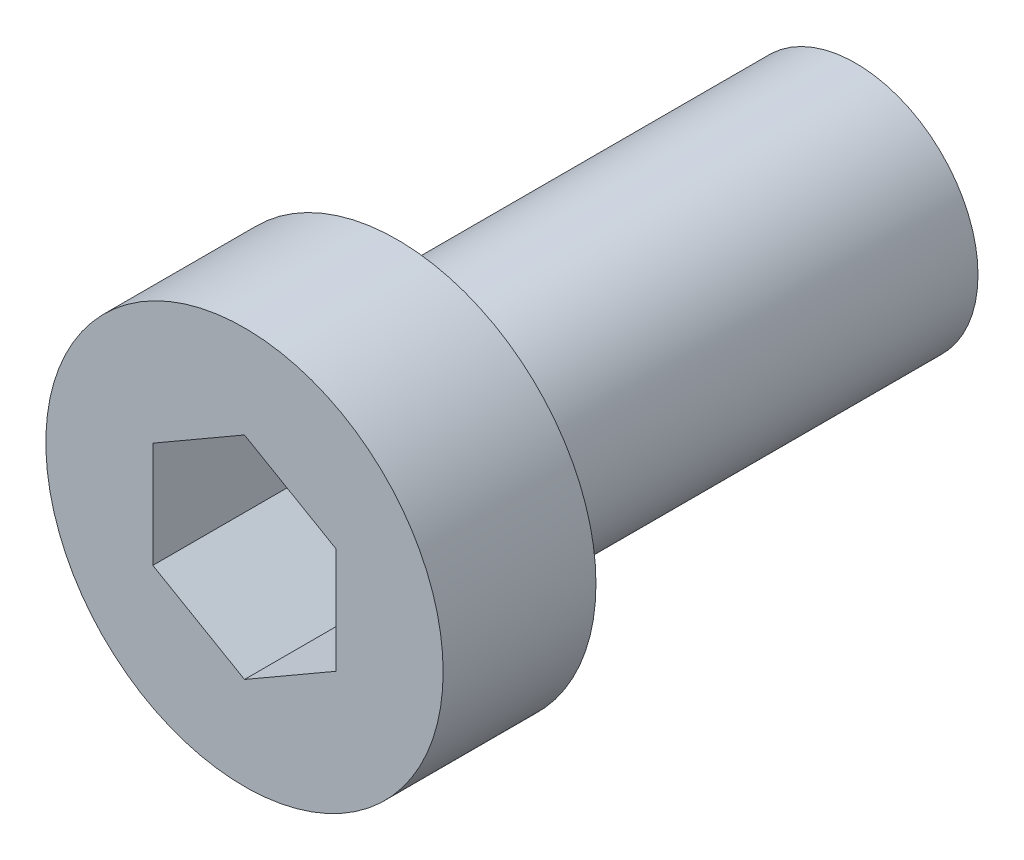
ISO-10303-21;
HEADER;
FILE_DESCRIPTION(('STEP AP214'),'2;1');
FILE_NAME('part.step','',(''),(''),'','','');
FILE_SCHEMA(('AUTOMOTIVE_DESIGN { 1 0 10303 214 1 1 1 1 }'));
ENDSEC;
DATA;
#1=APPLICATION_CONTEXT('core data for automotive mechanical design processes');
#2=APPLICATION_PROTOCOL_DEFINITION('international standard','automotive_design',2000,#1);
#3=PRODUCT_CONTEXT('',#1,'mechanical');
#4=PRODUCT('Part','Part','',(#3));
#5=PRODUCT_RELATED_PRODUCT_CATEGORY('part','',(#4));
#6=PRODUCT_DEFINITION_FORMATION('','',#4);
#7=PRODUCT_DEFINITION_CONTEXT('part definition',#1,'design');
#8=PRODUCT_DEFINITION('design','',#6,#7);
#9=PRODUCT_DEFINITION_SHAPE('','',#8);
#10=(LENGTH_UNIT() NAMED_UNIT(*) SI_UNIT(.MILLI.,.METRE.));
#11=(NAMED_UNIT(*) PLANE_ANGLE_UNIT() SI_UNIT($,.RADIAN.));
#12=(NAMED_UNIT(*) SI_UNIT($,.STERADIAN.) SOLID_ANGLE_UNIT());
#13=UNCERTAINTY_MEASURE_WITH_UNIT(LENGTH_MEASURE(1.E-05),#10,'distance_accuracy_value','');
#14=(GEOMETRIC_REPRESENTATION_CONTEXT(3) GLOBAL_UNCERTAINTY_ASSIGNED_CONTEXT((#13)) GLOBAL_UNIT_ASSIGNED_CONTEXT((#10,
#11,#12)) REPRESENTATION_CONTEXT('',''));
#15=CARTESIAN_POINT('',(0.,0.,0.));
#16=DIRECTION('',(0.,0.,1.));
#17=DIRECTION('',(1.,0.,0.));
#18=AXIS2_PLACEMENT_3D('',#15,#16,#17);
#19=CARTESIAN_POINT('',(0.,0.,4.44089209850063E-13));
#20=DIRECTION('',(0.,0.,0.99999999999998));
#21=DIRECTION('',(1.,0.,0.));
#22=AXIS2_PLACEMENT_3D('',#19,#20,#21);
#23=PLANE('',#22);
#24=CARTESIAN_POINT('',(0.,0.,4.44089209850063E-13));
#25=DIRECTION('',(0.,0.,0.99999999999998));
#26=DIRECTION('',(1.,0.,0.));
#27=AXIS2_PLACEMENT_3D('',#24,#25,#26);
#28=CIRCLE('',#27,6.5);
#29=CARTESIAN_POINT('',(6.5,0.,4.47813769070422E-13));
#30=VERTEX_POINT('',#29);
#31=EDGE_CURVE('E157',#30,#30,#28,.T.);
#32=ORIENTED_EDGE('',*,*,#31,.F.);
#33=EDGE_LOOP('',(#32));
#34=FACE_BOUND('',#33,.T.);
#35=CARTESIAN_POINT('',(0.,0.,4.44089209850063E-13));
#36=DIRECTION('',(0.,0.,0.99999999999998));
#37=DIRECTION('',(1.,0.,0.));
#38=AXIS2_PLACEMENT_3D('',#35,#36,#37);
#39=CIRCLE('',#38,4.);
#40=CARTESIAN_POINT('',(4.,0.,4.46381246293361E-13));
#41=VERTEX_POINT('',#40);
#42=EDGE_CURVE('E11',#41,#41,#39,.F.);
#43=ORIENTED_EDGE('',*,*,#42,.F.);
#44=EDGE_LOOP('',(#43));
#45=FACE_BOUND('',#44,.T.);
#46=ADVANCED_FACE('F47',(#34,#45),#23,.F.);
#47=CARTESIAN_POINT('',(0.,0.,4.99999999999823));
#48=DIRECTION('',(0.,0.,-0.99999999999998));
#49=DIRECTION('',(-1.,0.,0.));
#50=AXIS2_PLACEMENT_3D('',#47,#48,#49);
#51=CYLINDRICAL_SURFACE('',#50,6.5);
#52=CARTESIAN_POINT('',(0.,0.,4.99999999999823));
#53=DIRECTION('',(0.,0.,0.99999999999998));
#54=DIRECTION('',(1.,0.,0.));
#55=AXIS2_PLACEMENT_3D('',#52,#53,#54);
#56=CIRCLE('',#55,6.5);
#57=CARTESIAN_POINT('',(6.5,0.,4.99999999999823));
#58=VERTEX_POINT('',#57);
#59=EDGE_CURVE('E55',#58,#58,#56,.T.);
#60=ORIENTED_EDGE('',*,*,#59,.F.);
#61=EDGE_LOOP('',(#60));
#62=FACE_BOUND('',#61,.T.);
#63=ORIENTED_EDGE('',*,*,#31,.T.);
#64=EDGE_LOOP('',(#63));
#65=FACE_BOUND('',#64,.T.);
#66=ADVANCED_FACE('F49',(#62,#65),#51,.T.);
#67=CARTESIAN_POINT('',(0.,0.,4.99999999999823));
#68=DIRECTION('',(0.,0.,0.99999999999998));
#69=DIRECTION('',(1.,0.,0.));
#70=AXIS2_PLACEMENT_3D('',#67,#68,#69);
#71=PLANE('',#70);
#72=DIRECTION('',(-0.866025403784439,0.50000000000001,0.));
#73=VECTOR('',#72,1.);
#74=CARTESIAN_POINT('',(2.99999999999989,1.73205080756874,4.99999999999778));
#75=LINE('',#74,#73);
#76=CARTESIAN_POINT('',(2.99999999999989,1.73205080756874,4.99999999999778));
#77=VERTEX_POINT('',#76);
#78=CARTESIAN_POINT('',(0.,3.46410161513778,4.99999999999834));
#79=VERTEX_POINT('',#78);
#80=EDGE_CURVE('E62',#77,#79,#75,.T.);
#81=ORIENTED_EDGE('',*,*,#80,.F.);
#82=DIRECTION('',(0.,1.00000000000002,0.));
#83=VECTOR('',#82,1.);
#84=CARTESIAN_POINT('',(2.99999999999989,-1.73205080756893,4.9999999999979));
#85=LINE('',#84,#83);
#86=CARTESIAN_POINT('',(2.99999999999989,-1.73205080756893,4.9999999999979));
#87=VERTEX_POINT('',#86);
#88=EDGE_CURVE('E145',#87,#77,#85,.T.);
#89=ORIENTED_EDGE('',*,*,#88,.F.);
#90=DIRECTION('',(0.866025403784439,0.500000000000009,0.));
#91=VECTOR('',#90,1.);
#92=CARTESIAN_POINT('',(0.,-3.46410161513781,4.99999999999934));
#93=LINE('',#92,#91);
#94=CARTESIAN_POINT('',(0.,-3.46410161513781,4.99999999999934));
#95=VERTEX_POINT('',#94);
#96=EDGE_CURVE('E143',#95,#87,#93,.T.);
#97=ORIENTED_EDGE('',*,*,#96,.F.);
#98=DIRECTION('',(0.866025403784439,-0.500000000000009,0.));
#99=VECTOR('',#98,1.);
#100=CARTESIAN_POINT('',(-3.00000000000011,-1.73205080756885,4.99999999999834));
#101=LINE('',#100,#99);
#102=CARTESIAN_POINT('',(-3.00000000000011,-1.73205080756885,4.99999999999834));
#103=VERTEX_POINT('',#102);
#104=EDGE_CURVE('E110',#103,#95,#101,.T.);
#105=ORIENTED_EDGE('',*,*,#104,.F.);
#106=DIRECTION('',(0.,-1.00000000000002,0.));
#107=VECTOR('',#106,1.);
#108=CARTESIAN_POINT('',(-2.99999999999989,1.73205080756896,4.99999999999823));
#109=LINE('',#108,#107);
#110=CARTESIAN_POINT('',(-2.99999999999989,1.73205080756896,4.99999999999823));
#111=VERTEX_POINT('',#110);
#112=EDGE_CURVE('E139',#111,#103,#109,.T.);
#113=ORIENTED_EDGE('',*,*,#112,.F.);
#114=DIRECTION('',(-0.866025403784439,-0.500000000000009,0.));
#115=VECTOR('',#114,1.);
#116=CARTESIAN_POINT('',(0.,3.46410161513778,4.99999999999834));
#117=LINE('',#116,#115);
#118=EDGE_CURVE('E136',#79,#111,#117,.T.);
#119=ORIENTED_EDGE('',*,*,#118,.F.);
#120=EDGE_LOOP('',(#81,#89,#97,#105,#113,#119));
#121=FACE_BOUND('',#120,.T.);
#122=ORIENTED_EDGE('',*,*,#59,.T.);
#123=EDGE_LOOP('',(#122));
#124=FACE_BOUND('',#123,.T.);
#125=ADVANCED_FACE('F170',(#121,#124),#71,.T.);
#126=CARTESIAN_POINT('',(0.,0.,-14.9999999999996));
#127=DIRECTION('',(0.,0.,0.99999999999998));
#128=DIRECTION('',(1.,0.,0.));
#129=AXIS2_PLACEMENT_3D('',#126,#127,#128);
#130=CYLINDRICAL_SURFACE('',#129,4.);
#131=CARTESIAN_POINT('',(0.,0.,-14.9999999999996));
#132=DIRECTION('',(0.,0.,-0.99999999999998));
#133=DIRECTION('',(-1.,0.,0.));
#134=AXIS2_PLACEMENT_3D('',#131,#132,#133);
#135=CIRCLE('',#134,4.);
#136=CARTESIAN_POINT('',(-4.,0.,-14.9999999999996));
#137=VERTEX_POINT('',#136);
#138=EDGE_CURVE('E149',#137,#137,#135,.T.);
#139=ORIENTED_EDGE('',*,*,#138,.F.);
#140=EDGE_LOOP('',(#139));
#141=FACE_BOUND('',#140,.T.);
#142=ORIENTED_EDGE('',*,*,#42,.T.);
#143=EDGE_LOOP('',(#142));
#144=FACE_BOUND('',#143,.T.);
#145=ADVANCED_FACE('F167',(#141,#144),#130,.T.);
#146=CARTESIAN_POINT('',(0.,0.,-14.9999999999996));
#147=DIRECTION('',(0.,0.,-0.99999999999998));
#148=DIRECTION('',(-1.,0.,0.));
#149=AXIS2_PLACEMENT_3D('',#146,#147,#148);
#150=PLANE('',#149);
#151=ORIENTED_EDGE('',*,*,#138,.T.);
#152=EDGE_LOOP('',(#151));
#153=FACE_BOUND('',#152,.T.);
#154=ADVANCED_FACE('F169',(#153),#150,.T.);
#155=CARTESIAN_POINT('',(2.99999999999989,1.73205080756881,0.));
#156=DIRECTION('',(0.5,0.866025403784458,0.));
#157=DIRECTION('',(-0.866025403784439,0.50000000000001,0.));
#158=AXIS2_PLACEMENT_3D('',#155,#156,#157);
#159=PLANE('',#158);
#160=ORIENTED_EDGE('',*,*,#80,.T.);
#161=DIRECTION('',(0.,0.,0.99999999999998));
#162=VECTOR('',#161,1.);
#163=CARTESIAN_POINT('',(0.,3.46410161513774,4.44089209850063E-13));
#164=LINE('',#163,#162);
#165=CARTESIAN_POINT('',(0.,3.46410161513774,4.44089209850063E-13));
#166=VERTEX_POINT('',#165);
#167=EDGE_CURVE('E92',#166,#79,#164,.T.);
#168=ORIENTED_EDGE('',*,*,#167,.F.);
#169=DIRECTION('',(-0.866025403784439,0.50000000000001,0.));
#170=VECTOR('',#169,1.);
#171=CARTESIAN_POINT('',(2.99999999999989,1.73205080756881,0.));
#172=LINE('',#171,#170);
#173=CARTESIAN_POINT('',(2.99999999999989,1.73205080756881,0.));
#174=VERTEX_POINT('',#173);
#175=EDGE_CURVE('E147',#174,#166,#172,.T.);
#176=ORIENTED_EDGE('',*,*,#175,.F.);
#177=DIRECTION('',(0.,0.,0.99999999999998));
#178=VECTOR('',#177,1.);
#179=CARTESIAN_POINT('',(2.99999999999989,1.73205080756881,0.));
#180=LINE('',#179,#178);
#181=EDGE_CURVE('E70',#174,#77,#180,.T.);
#182=ORIENTED_EDGE('',*,*,#181,.T.);
#183=EDGE_LOOP('',(#160,#168,#176,#182));
#184=FACE_BOUND('',#183,.T.);
#185=ADVANCED_FACE('F177',(#184),#159,.F.);
#186=CARTESIAN_POINT('',(2.99999999999989,-1.73205080756888,0.));
#187=DIRECTION('',(1.,0.,0.));
#188=DIRECTION('',(0.,0.,-0.99999999999998));
#189=AXIS2_PLACEMENT_3D('',#186,#187,#188);
#190=PLANE('',#189);
#191=ORIENTED_EDGE('',*,*,#88,.T.);
#192=ORIENTED_EDGE('',*,*,#181,.F.);
#193=DIRECTION('',(0.,1.00000000000002,0.));
#194=VECTOR('',#193,1.);
#195=CARTESIAN_POINT('',(2.99999999999989,-1.73205080756888,0.));
#196=LINE('',#195,#194);
#197=CARTESIAN_POINT('',(2.99999999999989,-1.73205080756888,0.));
#198=VERTEX_POINT('',#197);
#199=EDGE_CURVE('E122',#198,#174,#196,.T.);
#200=ORIENTED_EDGE('',*,*,#199,.F.);
#201=DIRECTION('',(0.,0.,0.99999999999998));
#202=VECTOR('',#201,1.);
#203=CARTESIAN_POINT('',(2.99999999999989,-1.73205080756888,0.));
#204=LINE('',#203,#202);
#205=EDGE_CURVE('E114',#198,#87,#204,.T.);
#206=ORIENTED_EDGE('',*,*,#205,.T.);
#207=EDGE_LOOP('',(#191,#192,#200,#206));
#208=FACE_BOUND('',#207,.T.);
#209=ADVANCED_FACE('F186',(#208),#190,.F.);
#210=CARTESIAN_POINT('',(0.,-3.46410161513789,4.44089209850063E-13));
#211=DIRECTION('',(0.500000000000001,-0.866025403784458,0.));
#212=DIRECTION('',(0.866025403784439,0.500000000000009,0.));
#213=AXIS2_PLACEMENT_3D('',#210,#211,#212);
#214=PLANE('',#213);
#215=ORIENTED_EDGE('',*,*,#96,.T.);
#216=ORIENTED_EDGE('',*,*,#205,.F.);
#217=DIRECTION('',(0.866025403784439,0.500000000000009,0.));
#218=VECTOR('',#217,1.);
#219=CARTESIAN_POINT('',(0.,-3.46410161513789,4.44089209850063E-13));
#220=LINE('',#219,#218);
#221=CARTESIAN_POINT('',(0.,-3.46410161513789,4.44089209850063E-13));
#222=VERTEX_POINT('',#221);
#223=EDGE_CURVE('E118',#222,#198,#220,.T.);
#224=ORIENTED_EDGE('',*,*,#223,.F.);
#225=DIRECTION('',(0.,0.,0.99999999999998));
#226=VECTOR('',#225,1.);
#227=CARTESIAN_POINT('',(0.,-3.46410161513789,4.44089209850063E-13));
#228=LINE('',#227,#226);
#229=EDGE_CURVE('E103',#222,#95,#228,.T.);
#230=ORIENTED_EDGE('',*,*,#229,.T.);
#231=EDGE_LOOP('',(#215,#216,#224,#230));
#232=FACE_BOUND('',#231,.T.);
#233=ADVANCED_FACE('F119',(#232),#214,.F.);
#234=CARTESIAN_POINT('',(-3.00000000000011,-1.73205080756889,4.44089209850063E-13));
#235=DIRECTION('',(-0.5,-0.866025403784458,0.));
#236=DIRECTION('',(0.866025403784439,-0.500000000000009,0.));
#237=AXIS2_PLACEMENT_3D('',#234,#235,#236);
#238=PLANE('',#237);
#239=ORIENTED_EDGE('',*,*,#104,.T.);
#240=ORIENTED_EDGE('',*,*,#229,.F.);
#241=DIRECTION('',(0.866025403784439,-0.500000000000009,0.));
#242=VECTOR('',#241,1.);
#243=CARTESIAN_POINT('',(-3.00000000000011,-1.73205080756889,4.44089209850063E-13));
#244=LINE('',#243,#242);
#245=CARTESIAN_POINT('',(-3.00000000000011,-1.73205080756889,4.44089209850063E-13));
#246=VERTEX_POINT('',#245);
#247=EDGE_CURVE('E107',#246,#222,#244,.T.);
#248=ORIENTED_EDGE('',*,*,#247,.F.);
#249=DIRECTION('',(0.,0.,0.99999999999998));
#250=VECTOR('',#249,1.);
#251=CARTESIAN_POINT('',(-3.00000000000011,-1.73205080756889,4.44089209850063E-13));
#252=LINE('',#251,#250);
#253=EDGE_CURVE('E115',#246,#103,#252,.T.);
#254=ORIENTED_EDGE('',*,*,#253,.T.);
#255=EDGE_LOOP('',(#239,#240,#248,#254));
#256=FACE_BOUND('',#255,.T.);
#257=ADVANCED_FACE('F105',(#256),#238,.F.);
#258=CARTESIAN_POINT('',(-2.99999999999989,1.73205080756889,4.44089209850063E-13));
#259=DIRECTION('',(-1.,0.,0.));
#260=DIRECTION('',(0.,-1.00000000000002,0.));
#261=AXIS2_PLACEMENT_3D('',#258,#259,#260);
#262=PLANE('',#261);
#263=ORIENTED_EDGE('',*,*,#112,.T.);
#264=ORIENTED_EDGE('',*,*,#253,.F.);
#265=DIRECTION('',(0.,-1.00000000000002,0.));
#266=VECTOR('',#265,1.);
#267=CARTESIAN_POINT('',(-2.99999999999989,1.73205080756889,4.44089209850063E-13));
#268=LINE('',#267,#266);
#269=CARTESIAN_POINT('',(-2.99999999999989,1.73205080756889,4.44089209850063E-13));
#270=VERTEX_POINT('',#269);
#271=EDGE_CURVE('E128',#270,#246,#268,.T.);
#272=ORIENTED_EDGE('',*,*,#271,.F.);
#273=DIRECTION('',(0.,0.,0.99999999999998));
#274=VECTOR('',#273,1.);
#275=CARTESIAN_POINT('',(-2.99999999999989,1.73205080756889,4.44089209850063E-13));
#276=LINE('',#275,#274);
#277=EDGE_CURVE('E152',#270,#111,#276,.T.);
#278=ORIENTED_EDGE('',*,*,#277,.T.);
#279=EDGE_LOOP('',(#263,#264,#272,#278));
#280=FACE_BOUND('',#279,.T.);
#281=ADVANCED_FACE('F190',(#280),#262,.F.);
#282=CARTESIAN_POINT('',(0.,3.46410161513774,4.44089209850063E-13));
#283=DIRECTION('',(-0.500000000000001,0.866025403784458,0.));
#284=DIRECTION('',(-0.866025403784439,-0.50000000000001,0.));
#285=AXIS2_PLACEMENT_3D('',#282,#283,#284);
#286=PLANE('',#285);
#287=ORIENTED_EDGE('',*,*,#118,.T.);
#288=ORIENTED_EDGE('',*,*,#277,.F.);
#289=DIRECTION('',(-0.866025403784439,-0.500000000000009,0.));
#290=VECTOR('',#289,1.);
#291=CARTESIAN_POINT('',(0.,3.46410161513774,4.44089209850063E-13));
#292=LINE('',#291,#290);
#293=EDGE_CURVE('E130',#166,#270,#292,.T.);
#294=ORIENTED_EDGE('',*,*,#293,.F.);
#295=ORIENTED_EDGE('',*,*,#167,.T.);
#296=EDGE_LOOP('',(#287,#288,#294,#295));
#297=FACE_BOUND('',#296,.T.);
#298=ADVANCED_FACE('F187',(#297),#286,.F.);
#299=CARTESIAN_POINT('',(-2.99999999999989,5.19615242270663,4.44089209850063E-13));
#300=DIRECTION('',(0.,0.,0.99999999999998));
#301=DIRECTION('',(1.,0.,0.));
#302=AXIS2_PLACEMENT_3D('',#299,#300,#301);
#303=PLANE('',#302);
#304=ORIENTED_EDGE('',*,*,#175,.T.);
#305=ORIENTED_EDGE('',*,*,#293,.T.);
#306=ORIENTED_EDGE('',*,*,#271,.T.);
#307=ORIENTED_EDGE('',*,*,#247,.T.);
#308=ORIENTED_EDGE('',*,*,#223,.T.);
#309=ORIENTED_EDGE('',*,*,#199,.T.);
#310=EDGE_LOOP('',(#304,#305,#306,#307,#308,#309));
#311=FACE_BOUND('',#310,.T.);
#312=ADVANCED_FACE('F125',(#311),#303,.T.);
#313=CLOSED_SHELL('',(#46,#66,#125,#145,#154,#185,#209,#233,#257,#281,#298,#312));
#314=MANIFOLD_SOLID_BREP('B2',#313);
#315=ADVANCED_BREP_SHAPE_REPRESENTATION('',(#18,#314),#14);
#316=SHAPE_DEFINITION_REPRESENTATION(#9,#315);
ENDSEC;
END-ISO-10303-21;
